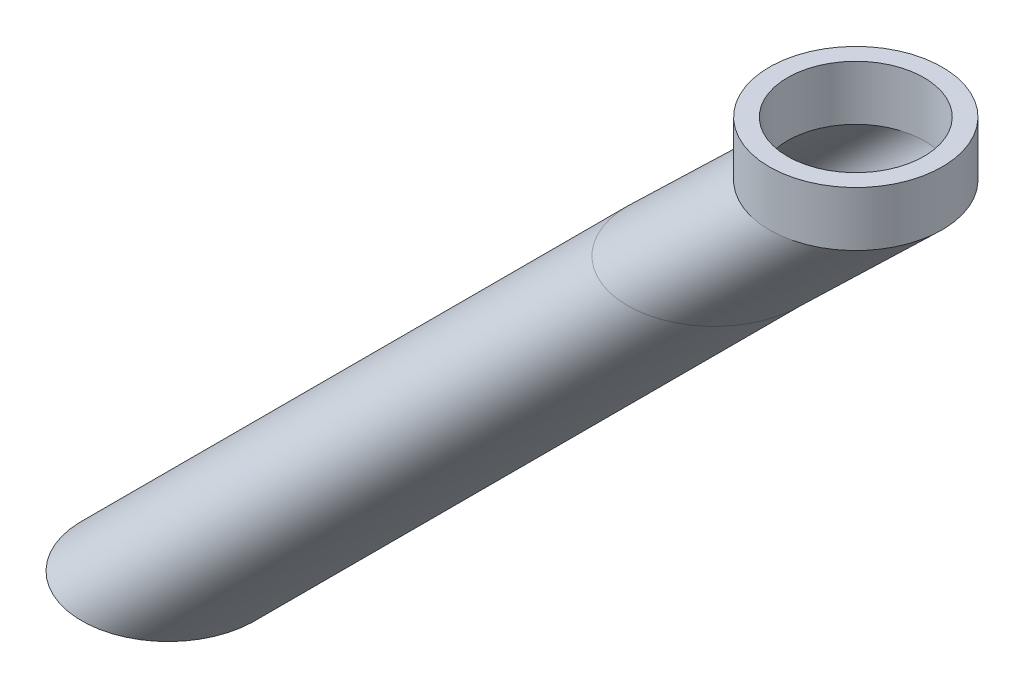
ISO-10303-21;
HEADER;
FILE_DESCRIPTION(('STEP AP214'),'2;1');
FILE_NAME('part.step','',(''),(''),'','','');
FILE_SCHEMA(('AUTOMOTIVE_DESIGN { 1 0 10303 214 1 1 1 1 }'));
ENDSEC;
DATA;
#1=APPLICATION_CONTEXT('core data for automotive mechanical design processes');
#2=APPLICATION_PROTOCOL_DEFINITION('international standard','automotive_design',2000,#1);
#3=PRODUCT_CONTEXT('',#1,'mechanical');
#4=PRODUCT('Part','Part','',(#3));
#5=PRODUCT_RELATED_PRODUCT_CATEGORY('part','',(#4));
#6=PRODUCT_DEFINITION_FORMATION('','',#4);
#7=PRODUCT_DEFINITION_CONTEXT('part definition',#1,'design');
#8=PRODUCT_DEFINITION('design','',#6,#7);
#9=PRODUCT_DEFINITION_SHAPE('','',#8);
#10=(LENGTH_UNIT() NAMED_UNIT(*) SI_UNIT(.MILLI.,.METRE.));
#11=(NAMED_UNIT(*) PLANE_ANGLE_UNIT() SI_UNIT($,.RADIAN.));
#12=(NAMED_UNIT(*) SI_UNIT($,.STERADIAN.) SOLID_ANGLE_UNIT());
#13=UNCERTAINTY_MEASURE_WITH_UNIT(LENGTH_MEASURE(1.E-05),#10,'distance_accuracy_value','');
#14=(GEOMETRIC_REPRESENTATION_CONTEXT(3) GLOBAL_UNCERTAINTY_ASSIGNED_CONTEXT((#13)) GLOBAL_UNIT_ASSIGNED_CONTEXT((#10,
#11,#12)) REPRESENTATION_CONTEXT('',''));
#15=CARTESIAN_POINT('',(0.,0.,0.));
#16=DIRECTION('',(0.,0.,1.));
#17=DIRECTION('',(1.,0.,0.));
#18=AXIS2_PLACEMENT_3D('',#15,#16,#17);
#19=CARTESIAN_POINT('',(0.,0.,9.5));
#20=CARTESIAN_POINT('',(15.5656846245115,15.,9.5));
#21=CARTESIAN_POINT('',(19.,0.,9.5));
#22=CARTESIAN_POINT('',(34.5656846245115,15.,9.5));
#23=CARTESIAN_POINT('',(19.,0.,-9.5));
#24=CARTESIAN_POINT('',(34.5656846245115,15.,-9.5));
#25=CARTESIAN_POINT('',(0.,0.,-9.5));
#26=CARTESIAN_POINT('',(15.5656846245115,15.,-9.5));
#27=CARTESIAN_POINT('',(-19.,0.,-9.5));
#28=CARTESIAN_POINT('',(-3.43431537548845,15.,-9.5));
#29=CARTESIAN_POINT('',(-19.,0.,9.5));
#30=CARTESIAN_POINT('',(-3.43431537548845,15.,9.5));
#31=CARTESIAN_POINT('',(0.,0.,9.5));
#32=CARTESIAN_POINT('',(15.5656846245115,15.,9.5));
#33=(BOUNDED_SURFACE() B_SPLINE_SURFACE(3,1,((#19,#20),(#21,#22),(#23,#24),(#25,#26),(#27,#28),
(#29,#30),(#31,#32)),.UNSPECIFIED.,.T.,.F.,.F.) B_SPLINE_SURFACE_WITH_KNOTS((4,3,4),(2,2),(0.,
0.5,1.),(0.,1.),.UNSPECIFIED.) GEOMETRIC_REPRESENTATION_ITEM() RATIONAL_B_SPLINE_SURFACE(((1.,
1.),(0.333333333333333,0.333333333333333),(0.333333333333333,0.333333333333333),(1.,1.),
(0.333333333333333,0.333333333333333),(0.333333333333333,0.333333333333333),(1.,1.))) REPRESENTATION_ITEM('') SURFACE());
#34=CARTESIAN_POINT('',(15.5656846245115,15.,0.));
#35=DIRECTION('',(0.,1.,0.));
#36=DIRECTION('',(0.,0.,1.));
#37=AXIS2_PLACEMENT_3D('',#34,#35,#36);
#38=CIRCLE('',#37,9.5);
#39=CARTESIAN_POINT('',(15.5656846245115,15.,9.5));
#40=VERTEX_POINT('',#39);
#41=EDGE_CURVE('E67',#40,#40,#38,.T.);
#42=CARTESIAN_POINT('',(0.,0.,0.));
#43=DIRECTION('',(0.,1.,0.));
#44=DIRECTION('',(0.,0.,1.));
#45=AXIS2_PLACEMENT_3D('',#42,#43,#44);
#46=CIRCLE('',#45,9.5);
#47=CARTESIAN_POINT('',(0.,0.,9.5));
#48=VERTEX_POINT('',#47);
#49=EDGE_CURVE('E64',#48,#48,#46,.T.);
#50=CARTESIAN_POINT('',(15.5656846245115,15.,9.5));
#51=CARTESIAN_POINT('',(15.4035420763395,14.84375,9.5));
#52=CARTESIAN_POINT('',(15.2413995281676,14.6875,9.5));
#53=CARTESIAN_POINT('',(14.9171144318236,14.375,9.5));
#54=CARTESIAN_POINT('',(14.7549718836516,14.21875,9.5));
#55=CARTESIAN_POINT('',(14.4306867873076,13.90625,9.5));
#56=CARTESIAN_POINT('',(14.2685442391356,13.75,9.5));
#57=CARTESIAN_POINT('',(13.9442591427916,13.4375,9.5));
#58=CARTESIAN_POINT('',(13.7821165946196,13.28125,9.5));
#59=CARTESIAN_POINT('',(13.4578314982756,12.96875,9.5));
#60=CARTESIAN_POINT('',(13.2956889501036,12.8125,9.5));
#61=CARTESIAN_POINT('',(12.9714038537596,12.5,9.5));
#62=CARTESIAN_POINT('',(12.8092613055876,12.34375,9.5));
#63=CARTESIAN_POINT('',(12.4849762092436,12.03125,9.5));
#64=CARTESIAN_POINT('',(12.3228336610716,11.875,9.5));
#65=CARTESIAN_POINT('',(11.9985485647276,11.5625,9.5));
#66=CARTESIAN_POINT('',(11.8364060165557,11.40625,9.5));
#67=CARTESIAN_POINT('',(11.5121209202117,11.09375,9.5));
#68=CARTESIAN_POINT('',(11.3499783720397,10.9375,9.5));
#69=CARTESIAN_POINT('',(11.0256932756957,10.625,9.5));
#70=CARTESIAN_POINT('',(10.8635507275237,10.46875,9.5));
#71=CARTESIAN_POINT('',(10.5392656311797,10.15625,9.5));
#72=CARTESIAN_POINT('',(10.3771230830077,10.,9.5));
#73=CARTESIAN_POINT('',(10.0528379866637,9.6875,9.5));
#74=CARTESIAN_POINT('',(9.89069543849171,9.53125,9.5));
#75=CARTESIAN_POINT('',(9.56641034214772,9.21875,9.5));
#76=CARTESIAN_POINT('',(9.40426779397573,9.0625,9.5));
#77=CARTESIAN_POINT('',(9.07998269763173,8.75,9.5));
#78=CARTESIAN_POINT('',(8.91784014945974,8.59375,9.5));
#79=CARTESIAN_POINT('',(8.59355505311575,8.28125,9.5));
#80=CARTESIAN_POINT('',(8.43141250494375,8.125,9.5));
#81=CARTESIAN_POINT('',(8.10712740859976,7.8125,9.5));
#82=CARTESIAN_POINT('',(7.94498486042777,7.65625,9.5));
#83=CARTESIAN_POINT('',(7.62069976408378,7.34375,9.5));
#84=CARTESIAN_POINT('',(7.45855721591178,7.1875,9.5));
#85=CARTESIAN_POINT('',(7.13427211956779,6.875,9.5));
#86=CARTESIAN_POINT('',(6.97212957139579,6.71875,9.5));
#87=CARTESIAN_POINT('',(6.6478444750518,6.40625,9.5));
#88=CARTESIAN_POINT('',(6.48570192687981,6.25,9.5));
#89=CARTESIAN_POINT('',(6.16141683053582,5.9375,9.5));
#90=CARTESIAN_POINT('',(5.99927428236382,5.78125,9.5));
#91=CARTESIAN_POINT('',(5.67498918601983,5.46875,9.5));
#92=CARTESIAN_POINT('',(5.51284663784784,5.3125,9.5));
#93=CARTESIAN_POINT('',(5.18856154150385,5.,9.5));
#94=CARTESIAN_POINT('',(5.02641899333185,4.84375,9.5));
#95=CARTESIAN_POINT('',(4.70213389698786,4.53125,9.5));
#96=CARTESIAN_POINT('',(4.53999134881587,4.375,9.5));
#97=CARTESIAN_POINT('',(4.21570625247188,4.0625,9.5));
#98=CARTESIAN_POINT('',(4.05356370429988,3.90625,9.5));
#99=CARTESIAN_POINT('',(3.72927860795589,3.59375,9.5));
#100=CARTESIAN_POINT('',(3.5671360597839,3.4375,9.5));
#101=CARTESIAN_POINT('',(3.2428509634399,3.125,9.5));
#102=CARTESIAN_POINT('',(3.08070841526791,2.96875,9.5));
#103=CARTESIAN_POINT('',(2.75642331892392,2.65625,9.5));
#104=CARTESIAN_POINT('',(2.59428077075192,2.5,9.5));
#105=CARTESIAN_POINT('',(2.26999567440793,2.1875,9.5));
#106=CARTESIAN_POINT('',(2.10785312623594,2.03125,9.5));
#107=CARTESIAN_POINT('',(1.78356802989195,1.71875,9.5));
#108=CARTESIAN_POINT('',(1.62142548171995,1.5625,9.5));
#109=CARTESIAN_POINT('',(1.29714038537596,1.25,9.5));
#110=CARTESIAN_POINT('',(1.13499783720397,1.09375,9.5));
#111=CARTESIAN_POINT('',(0.810712740859976,0.78125,9.5));
#112=CARTESIAN_POINT('',(0.648570192687981,0.625,9.5));
#113=CARTESIAN_POINT('',(0.32428509634399,0.3125,9.5));
#114=CARTESIAN_POINT('',(0.162142548171995,0.15625,9.5));
#115=CARTESIAN_POINT('',(0.,0.,9.5));
#116=B_SPLINE_CURVE_WITH_KNOTS('',3,(#50,#51,#52,#53,#54,#55,#56,#57,#58,#59,#60,#61,#62,#63,
#64,#65,#66,#67,#68,#69,#70,#71,#72,#73,#74,#75,#76,#77,#78,#79,#80,#81,#82,#83,#84,#85,#86,#87,
#88,#89,#90,#91,#92,#93,#94,#95,#96,#97,#98,#99,#100,#101,#102,#103,#104,#105,#106,#107,#108,
#109,#110,#111,#112,#113,#114,#115),.UNSPECIFIED.,.F.,.F.,(4,2,2,2,2,2,2,2,2,2,2,2,2,2,2,2,2,2,
2,2,2,2,2,2,2,2,2,2,2,2,2,2,4),(0.,0.675528249482855,1.35105649896571,2.02658474844856,
2.70211299793142,3.37764124741427,4.05316949689713,4.72869774637998,5.40422599586284,
6.07975424534569,6.75528249482855,7.4308107443114,8.10633899379426,8.78186724327711,
9.45739549275997,10.1329237422428,10.8084519917257,11.4839802412085,12.1595084906914,
12.8350367401742,13.5105649896571,14.18609323914,14.8616214886228,15.5371497381057,
16.2126779875885,16.8882062370714,17.5637344865542,18.2392627360371,18.9147909855199,
19.5903192350028,20.2658474844857,20.9413757339685,21.6169039834514),.UNSPECIFIED.);
#117=EDGE_CURVE('BSEAM33',#40,#48,#116,.T.);
#118=ORIENTED_EDGE('',*,*,#41,.F.);
#119=ORIENTED_EDGE('',*,*,#49,.T.);
#120=ORIENTED_EDGE('',*,*,#117,.T.);
#121=ORIENTED_EDGE('',*,*,#117,.F.);
#122=EDGE_LOOP('',(#118,#120,#119,#121));
#123=FACE_BOUND('',#122,.T.);
#124=ADVANCED_FACE('F33',(#123),#33,.T.);
#125=CARTESIAN_POINT('',(0.,0.,7.5));
#126=CARTESIAN_POINT('',(15.5656846245115,15.,7.5));
#127=CARTESIAN_POINT('',(-15.,0.,7.5));
#128=CARTESIAN_POINT('',(0.565684624511544,15.,7.5));
#129=CARTESIAN_POINT('',(-15.,0.,-7.5));
#130=CARTESIAN_POINT('',(0.565684624511547,15.,-7.5));
#131=CARTESIAN_POINT('',(0.,0.,-7.5));
#132=CARTESIAN_POINT('',(15.5656846245115,15.,-7.5));
#133=CARTESIAN_POINT('',(15.,0.,-7.5));
#134=CARTESIAN_POINT('',(30.5656846245115,15.,-7.5));
#135=CARTESIAN_POINT('',(15.,0.,7.5));
#136=CARTESIAN_POINT('',(30.5656846245115,15.,7.5));
#137=CARTESIAN_POINT('',(0.,0.,7.5));
#138=CARTESIAN_POINT('',(15.5656846245115,15.,7.5));
#139=(BOUNDED_SURFACE() B_SPLINE_SURFACE(3,1,((#125,#126),(#127,#128),(#129,#130),(#131,#132),
(#133,#134),(#135,#136),(#137,#138)),.UNSPECIFIED.,.T.,.F.,.F.) B_SPLINE_SURFACE_WITH_KNOTS((4,
3,4),(2,2),(0.,0.5,1.),(0.,1.),
.UNSPECIFIED.) GEOMETRIC_REPRESENTATION_ITEM() RATIONAL_B_SPLINE_SURFACE(((1.,1.),
(0.333333333333333,0.333333333333333),(0.333333333333333,0.333333333333333),(1.,1.),
(0.333333333333333,0.333333333333333),(0.333333333333333,0.333333333333333),(1.,1.))) REPRESENTATION_ITEM('') SURFACE());
#140=CARTESIAN_POINT('',(15.5656846245115,15.,0.));
#141=DIRECTION('',(0.,1.,0.));
#142=DIRECTION('',(0.,0.,1.));
#143=AXIS2_PLACEMENT_3D('',#140,#141,#142);
#144=CIRCLE('',#143,7.5);
#145=CARTESIAN_POINT('',(15.5656846245115,15.,7.5));
#146=VERTEX_POINT('',#145);
#147=EDGE_CURVE('E11',#146,#146,#144,.F.);
#148=CARTESIAN_POINT('',(0.,0.,0.));
#149=DIRECTION('',(0.,1.,0.));
#150=DIRECTION('',(0.,0.,1.));
#151=AXIS2_PLACEMENT_3D('',#148,#149,#150);
#152=CIRCLE('',#151,7.5);
#153=CARTESIAN_POINT('',(0.,0.,7.5));
#154=VERTEX_POINT('',#153);
#155=EDGE_CURVE('E42',#154,#154,#152,.F.);
#156=CARTESIAN_POINT('',(15.5656846245115,15.,7.5));
#157=CARTESIAN_POINT('',(15.4035420763395,14.84375,7.5));
#158=CARTESIAN_POINT('',(15.2413995281676,14.6875,7.5));
#159=CARTESIAN_POINT('',(14.9171144318236,14.375,7.5));
#160=CARTESIAN_POINT('',(14.7549718836516,14.21875,7.5));
#161=CARTESIAN_POINT('',(14.4306867873076,13.90625,7.5));
#162=CARTESIAN_POINT('',(14.2685442391356,13.75,7.5));
#163=CARTESIAN_POINT('',(13.9442591427916,13.4375,7.5));
#164=CARTESIAN_POINT('',(13.7821165946196,13.28125,7.5));
#165=CARTESIAN_POINT('',(13.4578314982756,12.96875,7.5));
#166=CARTESIAN_POINT('',(13.2956889501036,12.8125,7.5));
#167=CARTESIAN_POINT('',(12.9714038537596,12.5,7.5));
#168=CARTESIAN_POINT('',(12.8092613055876,12.34375,7.5));
#169=CARTESIAN_POINT('',(12.4849762092436,12.03125,7.5));
#170=CARTESIAN_POINT('',(12.3228336610716,11.875,7.5));
#171=CARTESIAN_POINT('',(11.9985485647276,11.5625,7.5));
#172=CARTESIAN_POINT('',(11.8364060165557,11.40625,7.5));
#173=CARTESIAN_POINT('',(11.5121209202117,11.09375,7.5));
#174=CARTESIAN_POINT('',(11.3499783720397,10.9375,7.5));
#175=CARTESIAN_POINT('',(11.0256932756957,10.625,7.5));
#176=CARTESIAN_POINT('',(10.8635507275237,10.46875,7.5));
#177=CARTESIAN_POINT('',(10.5392656311797,10.15625,7.5));
#178=CARTESIAN_POINT('',(10.3771230830077,10.,7.5));
#179=CARTESIAN_POINT('',(10.0528379866637,9.6875,7.5));
#180=CARTESIAN_POINT('',(9.89069543849171,9.53125,7.5));
#181=CARTESIAN_POINT('',(9.56641034214772,9.21875,7.5));
#182=CARTESIAN_POINT('',(9.40426779397573,9.0625,7.5));
#183=CARTESIAN_POINT('',(9.07998269763173,8.75,7.5));
#184=CARTESIAN_POINT('',(8.91784014945974,8.59375,7.5));
#185=CARTESIAN_POINT('',(8.59355505311575,8.28125,7.5));
#186=CARTESIAN_POINT('',(8.43141250494375,8.125,7.5));
#187=CARTESIAN_POINT('',(8.10712740859976,7.8125,7.5));
#188=CARTESIAN_POINT('',(7.94498486042777,7.65625,7.5));
#189=CARTESIAN_POINT('',(7.62069976408378,7.34375,7.5));
#190=CARTESIAN_POINT('',(7.45855721591178,7.1875,7.5));
#191=CARTESIAN_POINT('',(7.13427211956779,6.875,7.5));
#192=CARTESIAN_POINT('',(6.97212957139579,6.71875,7.5));
#193=CARTESIAN_POINT('',(6.6478444750518,6.40625,7.5));
#194=CARTESIAN_POINT('',(6.48570192687981,6.25,7.5));
#195=CARTESIAN_POINT('',(6.16141683053582,5.9375,7.5));
#196=CARTESIAN_POINT('',(5.99927428236382,5.78125,7.5));
#197=CARTESIAN_POINT('',(5.67498918601983,5.46875,7.5));
#198=CARTESIAN_POINT('',(5.51284663784784,5.3125,7.5));
#199=CARTESIAN_POINT('',(5.18856154150385,5.,7.5));
#200=CARTESIAN_POINT('',(5.02641899333185,4.84375,7.5));
#201=CARTESIAN_POINT('',(4.70213389698786,4.53125,7.5));
#202=CARTESIAN_POINT('',(4.53999134881587,4.375,7.5));
#203=CARTESIAN_POINT('',(4.21570625247188,4.0625,7.5));
#204=CARTESIAN_POINT('',(4.05356370429988,3.90625,7.5));
#205=CARTESIAN_POINT('',(3.72927860795589,3.59375,7.5));
#206=CARTESIAN_POINT('',(3.5671360597839,3.4375,7.5));
#207=CARTESIAN_POINT('',(3.2428509634399,3.125,7.5));
#208=CARTESIAN_POINT('',(3.08070841526791,2.96875,7.5));
#209=CARTESIAN_POINT('',(2.75642331892392,2.65625,7.5));
#210=CARTESIAN_POINT('',(2.59428077075192,2.5,7.5));
#211=CARTESIAN_POINT('',(2.26999567440793,2.1875,7.5));
#212=CARTESIAN_POINT('',(2.10785312623594,2.03125,7.5));
#213=CARTESIAN_POINT('',(1.78356802989195,1.71875,7.5));
#214=CARTESIAN_POINT('',(1.62142548171995,1.5625,7.5));
#215=CARTESIAN_POINT('',(1.29714038537596,1.25,7.5));
#216=CARTESIAN_POINT('',(1.13499783720397,1.09375,7.5));
#217=CARTESIAN_POINT('',(0.810712740859976,0.78125,7.5));
#218=CARTESIAN_POINT('',(0.648570192687981,0.625,7.5));
#219=CARTESIAN_POINT('',(0.32428509634399,0.3125,7.5));
#220=CARTESIAN_POINT('',(0.162142548171995,0.15625,7.5));
#221=CARTESIAN_POINT('',(0.,0.,7.5));
#222=B_SPLINE_CURVE_WITH_KNOTS('',3,(#156,#157,#158,#159,#160,#161,#162,#163,#164,#165,#166,
#167,#168,#169,#170,#171,#172,#173,#174,#175,#176,#177,#178,#179,#180,#181,#182,#183,#184,#185,
#186,#187,#188,#189,#190,#191,#192,#193,#194,#195,#196,#197,#198,#199,#200,#201,#202,#203,#204,
#205,#206,#207,#208,#209,#210,#211,#212,#213,#214,#215,#216,#217,#218,#219,#220,#221),
.UNSPECIFIED.,.F.,.F.,(4,2,2,2,2,2,2,2,2,2,2,2,2,2,2,2,2,2,2,2,2,2,2,2,2,2,2,2,2,2,2,2,4),(0.,
0.675528249482855,1.35105649896571,2.02658474844856,2.70211299793142,3.37764124741427,
4.05316949689713,4.72869774637998,5.40422599586284,6.07975424534569,6.75528249482855,
7.4308107443114,8.10633899379426,8.78186724327711,9.45739549275997,10.1329237422428,
10.8084519917257,11.4839802412085,12.1595084906914,12.8350367401742,13.5105649896571,
14.18609323914,14.8616214886228,15.5371497381057,16.2126779875885,16.8882062370714,
17.5637344865542,18.2392627360371,18.9147909855199,19.5903192350028,20.2658474844857,
20.9413757339685,21.6169039834514),.UNSPECIFIED.);
#223=EDGE_CURVE('BSEAM76',#146,#154,#222,.T.);
#224=ORIENTED_EDGE('',*,*,#147,.F.);
#225=ORIENTED_EDGE('',*,*,#155,.T.);
#226=ORIENTED_EDGE('',*,*,#223,.T.);
#227=ORIENTED_EDGE('',*,*,#223,.F.);
#228=EDGE_LOOP('',(#224,#226,#225,#227));
#229=FACE_BOUND('',#228,.T.);
#230=ADVANCED_FACE('F76',(#229),#139,.T.);
#231=CARTESIAN_POINT('',(15.5656846245115,21.,0.));
#232=DIRECTION('',(0.,1.,0.));
#233=DIRECTION('',(0.,0.,1.));
#234=AXIS2_PLACEMENT_3D('',#231,#232,#233);
#235=PLANE('',#234);
#236=CARTESIAN_POINT('',(15.5656846245115,21.,0.));
#237=DIRECTION('',(0.,1.,0.));
#238=DIRECTION('',(0.,0.,1.));
#239=AXIS2_PLACEMENT_3D('',#236,#237,#238);
#240=CIRCLE('',#239,9.5);
#241=CARTESIAN_POINT('',(15.5656846245115,21.,9.5));
#242=VERTEX_POINT('',#241);
#243=EDGE_CURVE('E58',#242,#242,#240,.T.);
#244=ORIENTED_EDGE('',*,*,#243,.T.);
#245=EDGE_LOOP('',(#244));
#246=FACE_BOUND('',#245,.T.);
#247=CARTESIAN_POINT('',(15.5656846245115,21.,0.));
#248=DIRECTION('',(0.,1.,0.));
#249=DIRECTION('',(0.,0.,1.));
#250=AXIS2_PLACEMENT_3D('',#247,#248,#249);
#251=CIRCLE('',#250,7.5);
#252=CARTESIAN_POINT('',(15.5656846245115,21.,7.5));
#253=VERTEX_POINT('',#252);
#254=EDGE_CURVE('E55',#253,#253,#251,.T.);
#255=ORIENTED_EDGE('',*,*,#254,.F.);
#256=EDGE_LOOP('',(#255));
#257=FACE_BOUND('',#256,.T.);
#258=ADVANCED_FACE('F77',(#246,#257),#235,.T.);
#259=CARTESIAN_POINT('',(15.5656846245115,21.,0.));
#260=DIRECTION('',(0.,-1.,0.));
#261=DIRECTION('',(0.,0.,-1.));
#262=AXIS2_PLACEMENT_3D('',#259,#260,#261);
#263=CYLINDRICAL_SURFACE('',#262,9.5);
#264=ORIENTED_EDGE('',*,*,#243,.F.);
#265=EDGE_LOOP('',(#264));
#266=FACE_BOUND('',#265,.T.);
#267=ORIENTED_EDGE('',*,*,#41,.T.);
#268=EDGE_LOOP('',(#267));
#269=FACE_BOUND('',#268,.T.);
#270=ADVANCED_FACE('F72',(#266,#269),#263,.T.);
#271=CARTESIAN_POINT('',(15.5656846245115,21.,0.));
#272=DIRECTION('',(0.,-1.,0.));
#273=DIRECTION('',(0.,0.,-1.));
#274=AXIS2_PLACEMENT_3D('',#271,#272,#273);
#275=CYLINDRICAL_SURFACE('',#274,7.5);
#276=ORIENTED_EDGE('',*,*,#254,.T.);
#277=EDGE_LOOP('',(#276));
#278=FACE_BOUND('',#277,.T.);
#279=ORIENTED_EDGE('',*,*,#147,.T.);
#280=EDGE_LOOP('',(#279));
#281=FACE_BOUND('',#280,.T.);
#282=ADVANCED_FACE('F82',(#278,#281),#275,.F.);
#283=CARTESIAN_POINT('',(0.,0.,-9.5));
#284=CARTESIAN_POINT('',(-59.9999999999993,-60.,-9.5));
#285=CARTESIAN_POINT('',(19.,0.,-9.5));
#286=CARTESIAN_POINT('',(-40.9999999999993,-60.,-9.5));
#287=CARTESIAN_POINT('',(19.,0.,9.5));
#288=CARTESIAN_POINT('',(-40.9999999999993,-60.,9.5));
#289=CARTESIAN_POINT('',(0.,0.,9.5));
#290=CARTESIAN_POINT('',(-59.9999999999993,-60.,9.5));
#291=CARTESIAN_POINT('',(-19.,0.,9.5));
#292=CARTESIAN_POINT('',(-78.9999999999993,-60.,9.5));
#293=CARTESIAN_POINT('',(-19.,0.,-9.5));
#294=CARTESIAN_POINT('',(-78.9999999999993,-60.,-9.5));
#295=CARTESIAN_POINT('',(0.,0.,-9.5));
#296=CARTESIAN_POINT('',(-59.9999999999993,-60.,-9.5));
#297=(BOUNDED_SURFACE() B_SPLINE_SURFACE(3,1,((#283,#284),(#285,#286),(#287,#288),(#289,#290),
(#291,#292),(#293,#294),(#295,#296)),.UNSPECIFIED.,.T.,.F.,.F.) B_SPLINE_SURFACE_WITH_KNOTS((4,
3,4),(2,2),(0.,0.5,1.),(0.,1.),
.UNSPECIFIED.) GEOMETRIC_REPRESENTATION_ITEM() RATIONAL_B_SPLINE_SURFACE(((1.,1.),
(0.333333333333333,0.333333333333333),(0.333333333333333,0.333333333333333),(1.,1.),
(0.333333333333333,0.333333333333333),(0.333333333333333,0.333333333333333),(1.,1.))) REPRESENTATION_ITEM('') SURFACE());
#298=CARTESIAN_POINT('',(-59.9999999999993,-60.,0.));
#299=DIRECTION('',(0.,-1.,0.));
#300=DIRECTION('',(0.,0.,-1.));
#301=AXIS2_PLACEMENT_3D('',#298,#299,#300);
#302=CIRCLE('',#301,9.5);
#303=CARTESIAN_POINT('',(-59.9999999999993,-60.,-9.5));
#304=VERTEX_POINT('',#303);
#305=EDGE_CURVE('E47',#304,#304,#302,.T.);
#306=ORIENTED_EDGE('',*,*,#305,.F.);
#307=EDGE_LOOP('',(#306));
#308=FACE_BOUND('',#307,.T.);
#309=ORIENTED_EDGE('',*,*,#49,.F.);
#310=EDGE_LOOP('',(#309));
#311=FACE_BOUND('',#310,.T.);
#312=ADVANCED_FACE('F80',(#308,#311),#297,.T.);
#313=CARTESIAN_POINT('',(-59.9999999999993,-60.,0.));
#314=DIRECTION('',(0.,-1.,0.));
#315=DIRECTION('',(0.,0.,-1.));
#316=AXIS2_PLACEMENT_3D('',#313,#314,#315);
#317=PLANE('',#316);
#318=CARTESIAN_POINT('',(-59.9999999999993,-60.,0.));
#319=DIRECTION('',(0.,-1.,0.));
#320=DIRECTION('',(0.,0.,-1.));
#321=AXIS2_PLACEMENT_3D('',#318,#319,#320);
#322=CIRCLE('',#321,7.5);
#323=CARTESIAN_POINT('',(-59.9999999999993,-60.,-7.5));
#324=VERTEX_POINT('',#323);
#325=EDGE_CURVE('E51',#324,#324,#322,.F.);
#326=ORIENTED_EDGE('',*,*,#325,.T.);
#327=EDGE_LOOP('',(#326));
#328=FACE_BOUND('',#327,.T.);
#329=ORIENTED_EDGE('',*,*,#305,.T.);
#330=EDGE_LOOP('',(#329));
#331=FACE_BOUND('',#330,.T.);
#332=ADVANCED_FACE('F52',(#328,#331),#317,.T.);
#333=CARTESIAN_POINT('',(0.,0.,-7.5));
#334=CARTESIAN_POINT('',(-59.9999999999993,-60.,-7.5));
#335=CARTESIAN_POINT('',(-15.,0.,-7.5));
#336=CARTESIAN_POINT('',(-74.9999999999993,-60.,-7.5));
#337=CARTESIAN_POINT('',(-15.,0.,7.5));
#338=CARTESIAN_POINT('',(-74.9999999999993,-60.,7.5));
#339=CARTESIAN_POINT('',(0.,0.,7.5));
#340=CARTESIAN_POINT('',(-59.9999999999993,-60.,7.5));
#341=CARTESIAN_POINT('',(15.,0.,7.5));
#342=CARTESIAN_POINT('',(-44.9999999999993,-60.,7.5));
#343=CARTESIAN_POINT('',(15.,0.,-7.5));
#344=CARTESIAN_POINT('',(-44.9999999999993,-60.,-7.5));
#345=CARTESIAN_POINT('',(0.,0.,-7.5));
#346=CARTESIAN_POINT('',(-59.9999999999993,-60.,-7.5));
#347=(BOUNDED_SURFACE() B_SPLINE_SURFACE(3,1,((#333,#334),(#335,#336),(#337,#338),(#339,#340),
(#341,#342),(#343,#344),(#345,#346)),.UNSPECIFIED.,.T.,.F.,.F.) B_SPLINE_SURFACE_WITH_KNOTS((4,
3,4),(2,2),(0.,0.5,1.),(0.,1.),
.UNSPECIFIED.) GEOMETRIC_REPRESENTATION_ITEM() RATIONAL_B_SPLINE_SURFACE(((1.,1.),
(0.333333333333333,0.333333333333333),(0.333333333333333,0.333333333333333),(1.,1.),
(0.333333333333333,0.333333333333333),(0.333333333333333,0.333333333333333),(1.,1.))) REPRESENTATION_ITEM('') SURFACE());
#348=ORIENTED_EDGE('',*,*,#325,.F.);
#349=EDGE_LOOP('',(#348));
#350=FACE_BOUND('',#349,.T.);
#351=ORIENTED_EDGE('',*,*,#155,.F.);
#352=EDGE_LOOP('',(#351));
#353=FACE_BOUND('',#352,.T.);
#354=ADVANCED_FACE('F88',(#350,#353),#347,.T.);
#355=CLOSED_SHELL('',(#124,#230,#258,#270,#282,#312,#332,#354));
#356=MANIFOLD_SOLID_BREP('B2',#355);
#357=ADVANCED_BREP_SHAPE_REPRESENTATION('',(#18,#356),#14);
#358=SHAPE_DEFINITION_REPRESENTATION(#9,#357);
ENDSEC;
END-ISO-10303-21;
